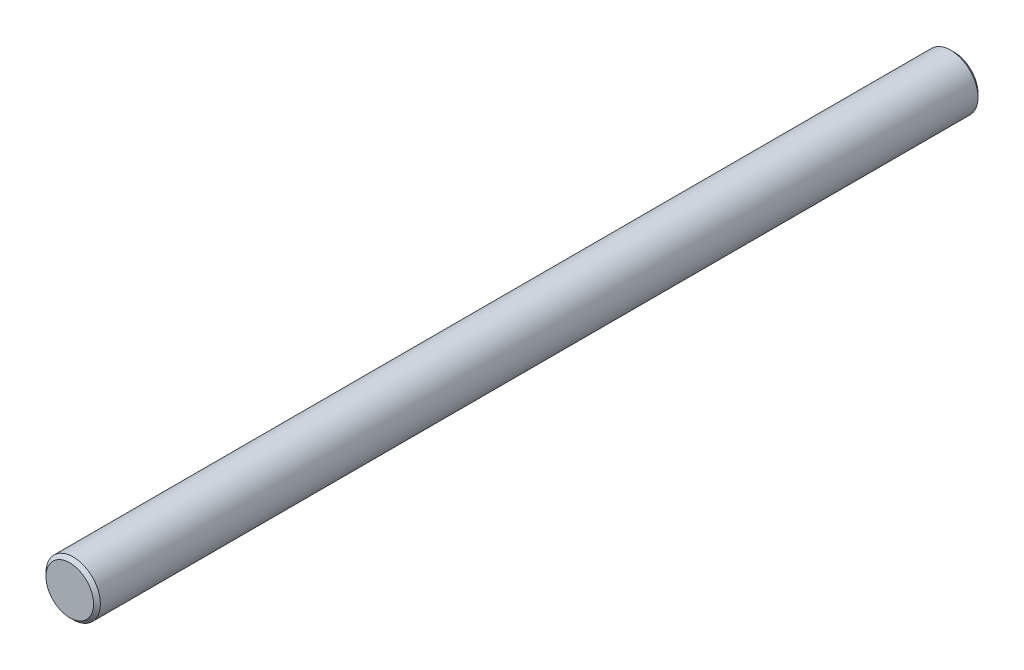
ISO-10303-21;
HEADER;
FILE_DESCRIPTION(('STEP AP214'),'2;1');
FILE_NAME('part.step','',(''),(''),'','','');
FILE_SCHEMA(('AUTOMOTIVE_DESIGN { 1 0 10303 214 1 1 1 1 }'));
ENDSEC;
DATA;
#1=APPLICATION_CONTEXT('core data for automotive mechanical design processes');
#2=APPLICATION_PROTOCOL_DEFINITION('international standard','automotive_design',2000,#1);
#3=PRODUCT_CONTEXT('',#1,'mechanical');
#4=PRODUCT('Part','Part','',(#3));
#5=PRODUCT_RELATED_PRODUCT_CATEGORY('part','',(#4));
#6=PRODUCT_DEFINITION_FORMATION('','',#4);
#7=PRODUCT_DEFINITION_CONTEXT('part definition',#1,'design');
#8=PRODUCT_DEFINITION('design','',#6,#7);
#9=PRODUCT_DEFINITION_SHAPE('','',#8);
#10=(LENGTH_UNIT() NAMED_UNIT(*) SI_UNIT(.MILLI.,.METRE.));
#11=(NAMED_UNIT(*) PLANE_ANGLE_UNIT() SI_UNIT($,.RADIAN.));
#12=(NAMED_UNIT(*) SI_UNIT($,.STERADIAN.) SOLID_ANGLE_UNIT());
#13=UNCERTAINTY_MEASURE_WITH_UNIT(LENGTH_MEASURE(1.E-05),#10,'distance_accuracy_value','');
#14=(GEOMETRIC_REPRESENTATION_CONTEXT(3) GLOBAL_UNCERTAINTY_ASSIGNED_CONTEXT((#13)) GLOBAL_UNIT_ASSIGNED_CONTEXT((#10,
#11,#12)) REPRESENTATION_CONTEXT('',''));
#15=CARTESIAN_POINT('',(0.,0.,0.));
#16=DIRECTION('',(0.,0.,1.));
#17=DIRECTION('',(1.,0.,0.));
#18=AXIS2_PLACEMENT_3D('',#15,#16,#17);
#19=CARTESIAN_POINT('',(0.,0.,130.));
#20=DIRECTION('',(0.,0.,-1.));
#21=DIRECTION('',(-1.,0.,0.));
#22=AXIS2_PLACEMENT_3D('',#19,#20,#21);
#23=CYLINDRICAL_SURFACE('',#22,4.);
#24=CARTESIAN_POINT('',(0.,0.,0.499999999999973));
#25=DIRECTION('',(0.,0.,1.));
#26=DIRECTION('',(1.,0.,0.));
#27=AXIS2_PLACEMENT_3D('',#24,#25,#26);
#28=CIRCLE('',#27,4.);
#29=CARTESIAN_POINT('',(4.,0.,0.499999999999973));
#30=VERTEX_POINT('',#29);
#31=EDGE_CURVE('E49',#30,#30,#28,.T.);
#32=ORIENTED_EDGE('',*,*,#31,.T.);
#33=EDGE_LOOP('',(#32));
#34=FACE_BOUND('',#33,.T.);
#35=CARTESIAN_POINT('',(0.,0.,129.5));
#36=DIRECTION('',(0.,0.,1.));
#37=DIRECTION('',(1.,0.,0.));
#38=AXIS2_PLACEMENT_3D('',#35,#36,#37);
#39=CIRCLE('',#38,4.);
#40=CARTESIAN_POINT('',(4.,0.,129.5));
#41=VERTEX_POINT('',#40);
#42=EDGE_CURVE('E53',#41,#41,#39,.F.);
#43=ORIENTED_EDGE('',*,*,#42,.T.);
#44=EDGE_LOOP('',(#43));
#45=FACE_BOUND('',#44,.T.);
#46=ADVANCED_FACE('F37',(#34,#45),#23,.T.);
#47=CARTESIAN_POINT('',(0.,0.,130.));
#48=DIRECTION('',(0.,0.,1.));
#49=DIRECTION('',(1.,0.,0.));
#50=AXIS2_PLACEMENT_3D('',#47,#48,#49);
#51=PLANE('',#50);
#52=CARTESIAN_POINT('',(0.,0.,130.));
#53=DIRECTION('',(0.,0.,1.));
#54=DIRECTION('',(1.,0.,0.));
#55=AXIS2_PLACEMENT_3D('',#52,#53,#54);
#56=CIRCLE('',#55,3.49999999999998);
#57=CARTESIAN_POINT('',(3.49999999999998,0.,130.));
#58=VERTEX_POINT('',#57);
#59=EDGE_CURVE('E10',#58,#58,#56,.T.);
#60=ORIENTED_EDGE('',*,*,#59,.T.);
#61=EDGE_LOOP('',(#60));
#62=FACE_BOUND('',#61,.T.);
#63=ADVANCED_FACE('F69',(#62),#51,.T.);
#64=CARTESIAN_POINT('',(0.,0.,0.));
#65=DIRECTION('',(0.,0.,1.));
#66=DIRECTION('',(1.,0.,0.));
#67=AXIS2_PLACEMENT_3D('',#64,#65,#66);
#68=PLANE('',#67);
#69=CARTESIAN_POINT('',(0.,0.,0.));
#70=DIRECTION('',(0.,0.,1.));
#71=DIRECTION('',(1.,0.,0.));
#72=AXIS2_PLACEMENT_3D('',#69,#70,#71);
#73=CIRCLE('',#72,3.50000000000002);
#74=CARTESIAN_POINT('',(3.50000000000002,0.,0.));
#75=VERTEX_POINT('',#74);
#76=EDGE_CURVE('E45',#75,#75,#73,.F.);
#77=ORIENTED_EDGE('',*,*,#76,.T.);
#78=EDGE_LOOP('',(#77));
#79=FACE_BOUND('',#78,.T.);
#80=ADVANCED_FACE('F66',(#79),#68,.F.);
#81=CARTESIAN_POINT('',(0.,0.,0.499999999999973));
#82=DIRECTION('',(0.,0.,1.));
#83=DIRECTION('',(1.,0.,0.));
#84=AXIS2_PLACEMENT_3D('',#81,#82,#83);
#85=CONICAL_SURFACE('',#84,4.,0.785398163397458);
#86=ORIENTED_EDGE('',*,*,#76,.F.);
#87=EDGE_LOOP('',(#86));
#88=FACE_BOUND('',#87,.T.);
#89=ORIENTED_EDGE('',*,*,#31,.F.);
#90=EDGE_LOOP('',(#89));
#91=FACE_BOUND('',#90,.T.);
#92=ADVANCED_FACE('F62',(#88,#91),#85,.T.);
#93=CARTESIAN_POINT('',(0.,0.,130.));
#94=DIRECTION('',(0.,0.,-1.));
#95=DIRECTION('',(-1.,0.,0.));
#96=AXIS2_PLACEMENT_3D('',#93,#94,#95);
#97=CONICAL_SURFACE('',#96,3.49999999999998,0.785398163397472);
#98=ORIENTED_EDGE('',*,*,#42,.F.);
#99=EDGE_LOOP('',(#98));
#100=FACE_BOUND('',#99,.T.);
#101=ORIENTED_EDGE('',*,*,#59,.F.);
#102=EDGE_LOOP('',(#101));
#103=FACE_BOUND('',#102,.T.);
#104=ADVANCED_FACE('F40',(#100,#103),#97,.T.);
#105=CLOSED_SHELL('',(#46,#63,#80,#92,#104));
#106=MANIFOLD_SOLID_BREP('B2',#105);
#107=ADVANCED_BREP_SHAPE_REPRESENTATION('',(#18,#106),#14);
#108=SHAPE_DEFINITION_REPRESENTATION(#9,#107);
ENDSEC;
END-ISO-10303-21;
